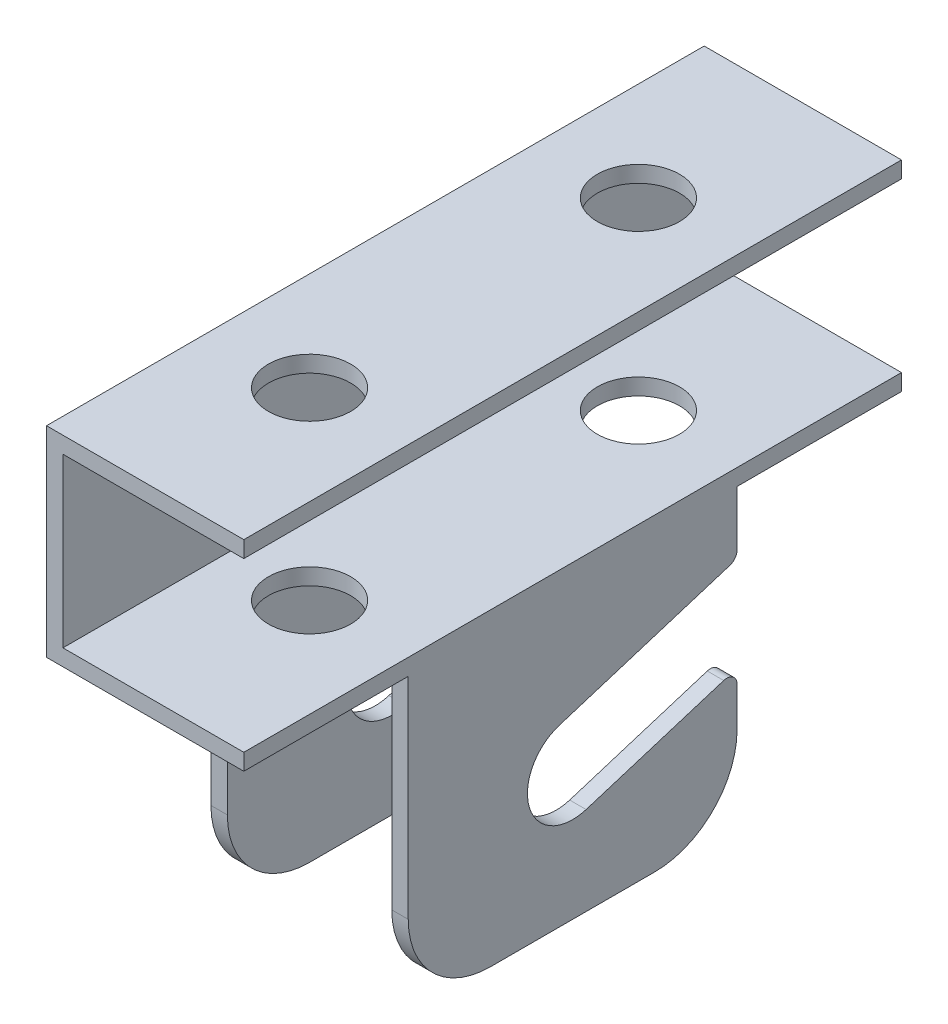
ISO-10303-21;
HEADER;
FILE_DESCRIPTION(('STEP AP214'),'2;1');
FILE_NAME('part.step','',(''),(''),'','','');
FILE_SCHEMA(('AUTOMOTIVE_DESIGN { 1 0 10303 214 1 1 1 1 }'));
ENDSEC;
DATA;
#1=APPLICATION_CONTEXT('core data for automotive mechanical design processes');
#2=APPLICATION_PROTOCOL_DEFINITION('international standard','automotive_design',2000,#1);
#3=PRODUCT_CONTEXT('',#1,'mechanical');
#4=PRODUCT('Part','Part','',(#3));
#5=PRODUCT_RELATED_PRODUCT_CATEGORY('part','',(#4));
#6=PRODUCT_DEFINITION_FORMATION('','',#4);
#7=PRODUCT_DEFINITION_CONTEXT('part definition',#1,'design');
#8=PRODUCT_DEFINITION('design','',#6,#7);
#9=PRODUCT_DEFINITION_SHAPE('','',#8);
#10=(LENGTH_UNIT() NAMED_UNIT(*) SI_UNIT(.MILLI.,.METRE.));
#11=(NAMED_UNIT(*) PLANE_ANGLE_UNIT() SI_UNIT($,.RADIAN.));
#12=(NAMED_UNIT(*) SI_UNIT($,.STERADIAN.) SOLID_ANGLE_UNIT());
#13=UNCERTAINTY_MEASURE_WITH_UNIT(LENGTH_MEASURE(1.E-05),#10,'distance_accuracy_value','');
#14=(GEOMETRIC_REPRESENTATION_CONTEXT(3) GLOBAL_UNCERTAINTY_ASSIGNED_CONTEXT((#13)) GLOBAL_UNIT_ASSIGNED_CONTEXT((#10,
#11,#12)) REPRESENTATION_CONTEXT('',''));
#15=CARTESIAN_POINT('',(0.,0.,0.));
#16=DIRECTION('',(0.,0.,1.));
#17=DIRECTION('',(1.,0.,0.));
#18=AXIS2_PLACEMENT_3D('',#15,#16,#17);
#19=CARTESIAN_POINT('',(0.,45.212,-25.4));
#20=DIRECTION('',(0.,0.,1.));
#21=DIRECTION('',(0.,-1.,0.));
#22=AXIS2_PLACEMENT_3D('',#19,#20,#21);
#23=PLANE('',#22);
#24=DIRECTION('',(0.,-1.,0.));
#25=VECTOR('',#24,1.);
#26=CARTESIAN_POINT('',(27.94,0.,-25.4));
#27=LINE('',#26,#25);
#28=CARTESIAN_POINT('',(27.94,18.7679927197062,-25.4));
#29=VERTEX_POINT('',#28);
#30=CARTESIAN_POINT('',(27.94,12.7,-25.4));
#31=VERTEX_POINT('',#30);
#32=EDGE_CURVE('E331',#29,#31,#27,.T.);
#33=ORIENTED_EDGE('',*,*,#32,.F.);
#34=DIRECTION('',(-1.,0.,0.));
#35=VECTOR('',#34,1.);
#36=CARTESIAN_POINT('',(0.,18.7679927197062,-25.4));
#37=LINE('',#36,#35);
#38=CARTESIAN_POINT('',(30.48,18.7679927197062,-25.4));
#39=VERTEX_POINT('',#38);
#40=EDGE_CURVE('E461',#29,#39,#37,.F.);
#41=ORIENTED_EDGE('',*,*,#40,.T.);
#42=DIRECTION('',(0.,1.,0.));
#43=VECTOR('',#42,1.);
#44=CARTESIAN_POINT('',(30.48,47.752,-25.4));
#45=LINE('',#44,#43);
#46=CARTESIAN_POINT('',(30.48,12.7,-25.4));
#47=VERTEX_POINT('',#46);
#48=EDGE_CURVE('E329',#47,#39,#45,.T.);
#49=ORIENTED_EDGE('',*,*,#48,.F.);
#50=DIRECTION('',(1.,0.,0.));
#51=VECTOR('',#50,1.);
#52=CARTESIAN_POINT('',(0.,12.7,-25.4));
#53=LINE('',#52,#51);
#54=EDGE_CURVE('E448',#47,#31,#53,.F.);
#55=ORIENTED_EDGE('',*,*,#54,.T.);
#56=EDGE_LOOP('',(#33,#41,#49,#55));
#57=FACE_BOUND('',#56,.T.);
#58=ADVANCED_FACE('F35',(#57),#23,.F.);
#59=DIRECTION('',(0.,-1.,0.));
#60=VECTOR('',#59,1.);
#61=CARTESIAN_POINT('',(0.,45.212,-25.4));
#62=LINE('',#61,#60);
#63=CARTESIAN_POINT('',(0.,18.7679927197062,-25.4));
#64=VERTEX_POINT('',#63);
#65=CARTESIAN_POINT('',(0.,12.7,-25.4));
#66=VERTEX_POINT('',#65);
#67=EDGE_CURVE('E316',#64,#66,#62,.T.);
#68=ORIENTED_EDGE('',*,*,#67,.F.);
#69=DIRECTION('',(1.,0.,0.));
#70=VECTOR('',#69,1.);
#71=CARTESIAN_POINT('',(0.,18.7679927197062,-25.4));
#72=LINE('',#71,#70);
#73=CARTESIAN_POINT('',(2.54,18.7679927197062,-25.4));
#74=VERTEX_POINT('',#73);
#75=EDGE_CURVE('E44',#64,#74,#72,.T.);
#76=ORIENTED_EDGE('',*,*,#75,.T.);
#77=DIRECTION('',(0.,1.,0.));
#78=VECTOR('',#77,1.);
#79=CARTESIAN_POINT('',(2.54,45.212,-25.4));
#80=LINE('',#79,#78);
#81=CARTESIAN_POINT('',(2.54,12.7,-25.4));
#82=VERTEX_POINT('',#81);
#83=EDGE_CURVE('E336',#82,#74,#80,.T.);
#84=ORIENTED_EDGE('',*,*,#83,.F.);
#85=DIRECTION('',(1.,0.,0.));
#86=VECTOR('',#85,1.);
#87=CARTESIAN_POINT('',(0.,12.7,-25.4));
#88=LINE('',#87,#86);
#89=EDGE_CURVE('E451',#82,#66,#88,.F.);
#90=ORIENTED_EDGE('',*,*,#89,.T.);
#91=EDGE_LOOP('',(#68,#76,#84,#90));
#92=FACE_BOUND('',#91,.T.);
#93=ADVANCED_FACE('F583',(#92),#23,.F.);
#94=CARTESIAN_POINT('',(2.54,0.,50.8));
#95=DIRECTION('',(0.,1.,0.));
#96=DIRECTION('',(-1.,0.,0.));
#97=AXIS2_PLACEMENT_3D('',#94,#95,#96);
#98=PLANE('',#97);
#99=DIRECTION('',(0.,0.,-1.));
#100=VECTOR('',#99,1.);
#101=CARTESIAN_POINT('',(2.54,0.,50.8));
#102=LINE('',#101,#100);
#103=CARTESIAN_POINT('',(2.54,0.,12.7));
#104=VERTEX_POINT('',#103);
#105=CARTESIAN_POINT('',(2.54,0.,-12.7));
#106=VERTEX_POINT('',#105);
#107=EDGE_CURVE('E413',#104,#106,#102,.T.);
#108=ORIENTED_EDGE('',*,*,#107,.F.);
#109=DIRECTION('',(1.,0.,0.));
#110=VECTOR('',#109,1.);
#111=CARTESIAN_POINT('',(2.54,0.,12.7));
#112=LINE('',#111,#110);
#113=CARTESIAN_POINT('',(0.,0.,12.7));
#114=VERTEX_POINT('',#113);
#115=EDGE_CURVE('E442',#104,#114,#112,.F.);
#116=ORIENTED_EDGE('',*,*,#115,.T.);
#117=DIRECTION('',(0.,0.,-1.));
#118=VECTOR('',#117,1.);
#119=CARTESIAN_POINT('',(0.,0.,50.8));
#120=LINE('',#119,#118);
#121=CARTESIAN_POINT('',(0.,0.,-12.7));
#122=VERTEX_POINT('',#121);
#123=EDGE_CURVE('E365',#114,#122,#120,.T.);
#124=ORIENTED_EDGE('',*,*,#123,.T.);
#125=DIRECTION('',(1.,0.,0.));
#126=VECTOR('',#125,1.);
#127=CARTESIAN_POINT('',(2.54,0.,-12.7));
#128=LINE('',#127,#126);
#129=EDGE_CURVE('E439',#122,#106,#128,.T.);
#130=ORIENTED_EDGE('',*,*,#129,.T.);
#131=EDGE_LOOP('',(#108,#116,#124,#130));
#132=FACE_BOUND('',#131,.T.);
#133=ADVANCED_FACE('F591',(#132),#98,.F.);
#134=CARTESIAN_POINT('',(2.54,45.212,50.8));
#135=DIRECTION('',(-1.,0.,0.));
#136=DIRECTION('',(0.,-1.,0.));
#137=AXIS2_PLACEMENT_3D('',#134,#135,#136);
#138=PLANE('',#137);
#139=DIRECTION('',(0.,0.297780601028373,-0.95463433504729));
#140=VECTOR('',#139,1.);
#141=CARTESIAN_POINT('',(2.54,14.7543797026228,41.2993062316393));
#142=LINE('',#141,#140);
#143=CARTESIAN_POINT('',(2.54,26.9881208303053,2.07999749818319));
#144=VERTEX_POINT('',#143);
#145=CARTESIAN_POINT('',(2.54,35.212266999136,-24.2852267041326));
#146=VERTEX_POINT('',#145);
#147=EDGE_CURVE('E290',#144,#146,#142,.T.);
#148=ORIENTED_EDGE('',*,*,#147,.T.);
#149=CARTESIAN_POINT('',(2.54,36.7277490060236,-23.8125));
#150=DIRECTION('',(-1.,0.,0.));
#151=DIRECTION('',(0.,-1.,0.));
#152=AXIS2_PLACEMENT_3D('',#149,#150,#151);
#153=CIRCLE('',#152,1.5875);
#154=CARTESIAN_POINT('',(2.54,36.7277490060236,-25.4));
#155=VERTEX_POINT('',#154);
#156=EDGE_CURVE('E481',#146,#155,#153,.F.);
#157=ORIENTED_EDGE('',*,*,#156,.T.);
#158=CARTESIAN_POINT('',(2.54,45.212,-25.4));
#159=VERTEX_POINT('',#158);
#160=EDGE_CURVE('E335',#155,#159,#80,.T.);
#161=ORIENTED_EDGE('',*,*,#160,.T.);
#162=DIRECTION('',(0.,0.,-1.));
#163=VECTOR('',#162,1.);
#164=CARTESIAN_POINT('',(2.54,45.212,50.8));
#165=LINE('',#164,#163);
#166=CARTESIAN_POINT('',(2.54,45.212,25.4));
#167=VERTEX_POINT('',#166);
#168=EDGE_CURVE('E410',#167,#159,#165,.T.);
#169=ORIENTED_EDGE('',*,*,#168,.F.);
#170=DIRECTION('',(0.,-1.,0.));
#171=VECTOR('',#170,1.);
#172=CARTESIAN_POINT('',(2.54,45.212,25.4));
#173=LINE('',#172,#171);
#174=CARTESIAN_POINT('',(2.54,12.7,25.4));
#175=VERTEX_POINT('',#174);
#176=EDGE_CURVE('E343',#167,#175,#173,.T.);
#177=ORIENTED_EDGE('',*,*,#176,.T.);
#178=CARTESIAN_POINT('',(2.54,12.7,12.7));
#179=DIRECTION('',(-1.,0.,0.));
#180=DIRECTION('',(0.,-1.,0.));
#181=AXIS2_PLACEMENT_3D('',#178,#179,#180);
#182=CIRCLE('',#181,12.7);
#183=EDGE_CURVE('E437',#175,#104,#182,.F.);
#184=ORIENTED_EDGE('',*,*,#183,.T.);
#185=ORIENTED_EDGE('',*,*,#107,.T.);
#186=CARTESIAN_POINT('',(2.54,12.7,-12.7));
#187=DIRECTION('',(-1.,0.,0.));
#188=DIRECTION('',(0.,-1.,0.));
#189=AXIS2_PLACEMENT_3D('',#186,#187,#188);
#190=CIRCLE('',#189,12.7);
#191=EDGE_CURVE('E435',#106,#82,#190,.F.);
#192=ORIENTED_EDGE('',*,*,#191,.T.);
#193=ORIENTED_EDGE('',*,*,#83,.T.);
#194=CARTESIAN_POINT('',(2.54,18.7679927197062,-23.8125));
#195=DIRECTION('',(-1.,0.,0.));
#196=DIRECTION('',(0.,-1.,0.));
#197=AXIS2_PLACEMENT_3D('',#194,#195,#196);
#198=CIRCLE('',#197,1.5875);
#199=CARTESIAN_POINT('',(2.54,20.2834747265937,-23.3397732958675));
#200=VERTEX_POINT('',#199);
#201=EDGE_CURVE('E52',#74,#200,#198,.F.);
#202=ORIENTED_EDGE('',*,*,#201,.T.);
#203=DIRECTION('',(0.,-0.297780601028374,0.95463433504729));
#204=VECTOR('',#203,1.);
#205=CARTESIAN_POINT('',(2.54,1.41813804201213,37.1393112352729));
#206=LINE('',#205,#204);
#207=CARTESIAN_POINT('',(2.54,13.6518791696947,-2.07999749818319));
#208=VERTEX_POINT('',#207);
#209=EDGE_CURVE('E296',#200,#208,#206,.T.);
#210=ORIENTED_EDGE('',*,*,#209,.T.);
#211=CARTESIAN_POINT('',(2.54,20.32,0.));
#212=DIRECTION('',(-1.,0.,0.));
#213=DIRECTION('',(0.,-1.,0.));
#214=AXIS2_PLACEMENT_3D('',#211,#212,#213);
#215=CIRCLE('',#214,6.985);
#216=EDGE_CURVE('E299',#208,#144,#215,.T.);
#217=ORIENTED_EDGE('',*,*,#216,.T.);
#218=EDGE_LOOP('',(#148,#157,#161,#169,#177,#184,#185,#192,#193,#202,#210,#217));
#219=FACE_BOUND('',#218,.T.);
#220=ADVANCED_FACE('F514',(#219),#138,.F.);
#221=CARTESIAN_POINT('',(27.94,45.212,50.8));
#222=DIRECTION('',(0.,1.,0.));
#223=DIRECTION('',(0.,0.,1.));
#224=AXIS2_PLACEMENT_3D('',#221,#222,#223);
#225=PLANE('',#224);
#226=CARTESIAN_POINT('',(15.24,45.212,-25.4));
#227=DIRECTION('',(0.,1.,0.));
#228=DIRECTION('',(0.,0.,1.));
#229=AXIS2_PLACEMENT_3D('',#226,#227,#228);
#230=CIRCLE('',#229,6.35);
#231=CARTESIAN_POINT('',(15.24,45.212,-19.05));
#232=VERTEX_POINT('',#231);
#233=EDGE_CURVE('E277',#232,#232,#230,.F.);
#234=ORIENTED_EDGE('',*,*,#233,.F.);
#235=EDGE_LOOP('',(#234));
#236=FACE_BOUND('',#235,.T.);
#237=CARTESIAN_POINT('',(15.24,45.212,25.4));
#238=DIRECTION('',(0.,1.,0.));
#239=DIRECTION('',(0.,0.,1.));
#240=AXIS2_PLACEMENT_3D('',#237,#238,#239);
#241=CIRCLE('',#240,6.35);
#242=CARTESIAN_POINT('',(15.24,45.212,31.75));
#243=VERTEX_POINT('',#242);
#244=EDGE_CURVE('E494',#243,#243,#241,.F.);
#245=ORIENTED_EDGE('',*,*,#244,.F.);
#246=EDGE_LOOP('',(#245));
#247=FACE_BOUND('',#246,.T.);
#248=DIRECTION('',(0.,0.,-1.));
#249=VECTOR('',#248,1.);
#250=CARTESIAN_POINT('',(27.94,45.212,50.8));
#251=LINE('',#250,#249);
#252=CARTESIAN_POINT('',(27.94,45.212,25.4));
#253=VERTEX_POINT('',#252);
#254=CARTESIAN_POINT('',(27.94,45.212,-25.4));
#255=VERTEX_POINT('',#254);
#256=EDGE_CURVE('E407',#253,#255,#251,.T.);
#257=ORIENTED_EDGE('',*,*,#256,.F.);
#258=DIRECTION('',(1.,0.,0.));
#259=VECTOR('',#258,1.);
#260=CARTESIAN_POINT('',(0.,45.212,25.4));
#261=LINE('',#260,#259);
#262=CARTESIAN_POINT('',(30.48,45.212,25.4));
#263=VERTEX_POINT('',#262);
#264=EDGE_CURVE('E309',#253,#263,#261,.T.);
#265=ORIENTED_EDGE('',*,*,#264,.T.);
#266=DIRECTION('',(0.,0.,-1.));
#267=VECTOR('',#266,1.);
#268=CARTESIAN_POINT('',(30.48,45.212,50.8));
#269=LINE('',#268,#267);
#270=CARTESIAN_POINT('',(30.48,45.212,50.8));
#271=VERTEX_POINT('',#270);
#272=EDGE_CURVE('E325',#271,#263,#269,.T.);
#273=ORIENTED_EDGE('',*,*,#272,.F.);
#274=DIRECTION('',(1.,0.,0.));
#275=VECTOR('',#274,1.);
#276=CARTESIAN_POINT('',(27.94,45.212,50.8));
#277=LINE('',#276,#275);
#278=CARTESIAN_POINT('',(0.,45.212,50.8));
#279=VERTEX_POINT('',#278);
#280=EDGE_CURVE('E347',#279,#271,#277,.T.);
#281=ORIENTED_EDGE('',*,*,#280,.F.);
#282=DIRECTION('',(0.,0.,1.));
#283=VECTOR('',#282,1.);
#284=CARTESIAN_POINT('',(0.,45.212,50.8));
#285=LINE('',#284,#283);
#286=CARTESIAN_POINT('',(0.,45.212,25.4));
#287=VERTEX_POINT('',#286);
#288=EDGE_CURVE('E305',#287,#279,#285,.T.);
#289=ORIENTED_EDGE('',*,*,#288,.F.);
#290=EDGE_CURVE('E310',#287,#167,#261,.T.);
#291=ORIENTED_EDGE('',*,*,#290,.T.);
#292=ORIENTED_EDGE('',*,*,#168,.T.);
#293=DIRECTION('',(1.,0.,0.));
#294=VECTOR('',#293,1.);
#295=CARTESIAN_POINT('',(0.,45.212,-25.4));
#296=LINE('',#295,#294);
#297=CARTESIAN_POINT('',(0.,45.212,-25.4));
#298=VERTEX_POINT('',#297);
#299=EDGE_CURVE('E306',#298,#159,#296,.T.);
#300=ORIENTED_EDGE('',*,*,#299,.F.);
#301=DIRECTION('',(0.,0.,1.));
#302=VECTOR('',#301,1.);
#303=CARTESIAN_POINT('',(0.,45.212,-50.8));
#304=LINE('',#303,#302);
#305=CARTESIAN_POINT('',(0.,45.212,-50.8));
#306=VERTEX_POINT('',#305);
#307=EDGE_CURVE('E302',#306,#298,#304,.T.);
#308=ORIENTED_EDGE('',*,*,#307,.F.);
#309=DIRECTION('',(1.,0.,0.));
#310=VECTOR('',#309,1.);
#311=CARTESIAN_POINT('',(27.94,45.212,-50.8));
#312=LINE('',#311,#310);
#313=CARTESIAN_POINT('',(30.48,45.212,-50.8));
#314=VERTEX_POINT('',#313);
#315=EDGE_CURVE('E346',#306,#314,#312,.T.);
#316=ORIENTED_EDGE('',*,*,#315,.T.);
#317=DIRECTION('',(0.,0.,-1.));
#318=VECTOR('',#317,1.);
#319=CARTESIAN_POINT('',(30.48,45.212,50.8));
#320=LINE('',#319,#318);
#321=CARTESIAN_POINT('',(30.48,45.212,-25.4));
#322=VERTEX_POINT('',#321);
#323=EDGE_CURVE('E313',#322,#314,#320,.T.);
#324=ORIENTED_EDGE('',*,*,#323,.F.);
#325=EDGE_CURVE('E320',#255,#322,#296,.T.);
#326=ORIENTED_EDGE('',*,*,#325,.F.);
#327=EDGE_LOOP('',(#257,#265,#273,#281,#289,#291,#292,#300,#308,#316,#324,#326));
#328=FACE_BOUND('',#327,.T.);
#329=ADVANCED_FACE('F510',(#236,#247,#328),#225,.F.);
#330=CARTESIAN_POINT('',(27.94,0.,50.8));
#331=DIRECTION('',(1.,0.,0.));
#332=DIRECTION('',(0.,1.,0.));
#333=AXIS2_PLACEMENT_3D('',#330,#331,#332);
#334=PLANE('',#333);
#335=DIRECTION('',(0.,0.297780601028374,-0.95463433504729));
#336=VECTOR('',#335,1.);
#337=CARTESIAN_POINT('',(27.94,-2.59095858039068,49.9917981838877));
#338=LINE('',#337,#336);
#339=CARTESIAN_POINT('',(27.94,13.6518791696947,-2.07999749818319));
#340=VERTEX_POINT('',#339);
#341=CARTESIAN_POINT('',(27.94,20.2834747265937,-23.3397732958675));
#342=VERTEX_POINT('',#341);
#343=EDGE_CURVE('E293',#340,#342,#338,.T.);
#344=ORIENTED_EDGE('',*,*,#343,.T.);
#345=CARTESIAN_POINT('',(27.94,18.7679927197062,-23.8125));
#346=DIRECTION('',(1.,0.,0.));
#347=DIRECTION('',(0.,1.,0.));
#348=AXIS2_PLACEMENT_3D('',#345,#346,#347);
#349=CIRCLE('',#348,1.5875);
#350=EDGE_CURVE('E459',#342,#29,#349,.F.);
#351=ORIENTED_EDGE('',*,*,#350,.T.);
#352=ORIENTED_EDGE('',*,*,#32,.T.);
#353=CARTESIAN_POINT('',(27.94,12.7,-12.7));
#354=DIRECTION('',(1.,0.,0.));
#355=DIRECTION('',(0.,1.,0.));
#356=AXIS2_PLACEMENT_3D('',#353,#354,#355);
#357=CIRCLE('',#356,12.7);
#358=CARTESIAN_POINT('',(27.94,0.,-12.7));
#359=VERTEX_POINT('',#358);
#360=EDGE_CURVE('E428',#31,#359,#357,.F.);
#361=ORIENTED_EDGE('',*,*,#360,.T.);
#362=DIRECTION('',(0.,0.,-1.));
#363=VECTOR('',#362,1.);
#364=CARTESIAN_POINT('',(27.94,0.,50.8));
#365=LINE('',#364,#363);
#366=CARTESIAN_POINT('',(27.94,0.,12.7));
#367=VERTEX_POINT('',#366);
#368=EDGE_CURVE('E404',#367,#359,#365,.T.);
#369=ORIENTED_EDGE('',*,*,#368,.F.);
#370=CARTESIAN_POINT('',(27.94,12.7,12.7));
#371=DIRECTION('',(1.,0.,0.));
#372=DIRECTION('',(0.,1.,0.));
#373=AXIS2_PLACEMENT_3D('',#370,#371,#372);
#374=CIRCLE('',#373,12.7);
#375=CARTESIAN_POINT('',(27.94,12.7,25.4));
#376=VERTEX_POINT('',#375);
#377=EDGE_CURVE('E430',#367,#376,#374,.F.);
#378=ORIENTED_EDGE('',*,*,#377,.T.);
#379=DIRECTION('',(0.,1.,0.));
#380=VECTOR('',#379,1.);
#381=CARTESIAN_POINT('',(27.94,0.,25.4));
#382=LINE('',#381,#380);
#383=EDGE_CURVE('E341',#376,#253,#382,.T.);
#384=ORIENTED_EDGE('',*,*,#383,.T.);
#385=ORIENTED_EDGE('',*,*,#256,.T.);
#386=CARTESIAN_POINT('',(27.94,36.7277490060236,-25.4));
#387=VERTEX_POINT('',#386);
#388=EDGE_CURVE('E332',#255,#387,#27,.T.);
#389=ORIENTED_EDGE('',*,*,#388,.T.);
#390=CARTESIAN_POINT('',(27.94,36.7277490060236,-23.8125));
#391=DIRECTION('',(1.,0.,0.));
#392=DIRECTION('',(0.,1.,0.));
#393=AXIS2_PLACEMENT_3D('',#390,#391,#392);
#394=CIRCLE('',#393,1.5875);
#395=CARTESIAN_POINT('',(27.94,35.212266999136,-24.2852267041326));
#396=VERTEX_POINT('',#395);
#397=EDGE_CURVE('E457',#387,#396,#394,.F.);
#398=ORIENTED_EDGE('',*,*,#397,.T.);
#399=DIRECTION('',(0.,-0.297780601028373,0.95463433504729));
#400=VECTOR('',#399,1.);
#401=CARTESIAN_POINT('',(27.94,10.74528308022,54.1517931802541));
#402=LINE('',#401,#400);
#403=CARTESIAN_POINT('',(27.94,26.9881208303053,2.07999749818319));
#404=VERTEX_POINT('',#403);
#405=EDGE_CURVE('E287',#396,#404,#402,.T.);
#406=ORIENTED_EDGE('',*,*,#405,.T.);
#407=CARTESIAN_POINT('',(27.94,20.32,0.));
#408=DIRECTION('',(1.,0.,0.));
#409=DIRECTION('',(0.,1.,0.));
#410=AXIS2_PLACEMENT_3D('',#407,#408,#409);
#411=CIRCLE('',#410,6.985);
#412=EDGE_CURVE('E253',#404,#340,#411,.T.);
#413=ORIENTED_EDGE('',*,*,#412,.T.);
#414=EDGE_LOOP('',(#344,#351,#352,#361,#369,#378,#384,#385,#389,#398,#406,#413));
#415=FACE_BOUND('',#414,.T.);
#416=ADVANCED_FACE('F513',(#415),#334,.F.);
#417=CARTESIAN_POINT('',(30.48,0.,50.8));
#418=DIRECTION('',(0.,1.,0.));
#419=DIRECTION('',(-1.,0.,0.));
#420=AXIS2_PLACEMENT_3D('',#417,#418,#419);
#421=PLANE('',#420);
#422=DIRECTION('',(0.,0.,-1.));
#423=VECTOR('',#422,1.);
#424=CARTESIAN_POINT('',(30.48,0.,50.8));
#425=LINE('',#424,#423);
#426=CARTESIAN_POINT('',(30.48,0.,12.7));
#427=VERTEX_POINT('',#426);
#428=CARTESIAN_POINT('',(30.48,0.,-12.7));
#429=VERTEX_POINT('',#428);
#430=EDGE_CURVE('E401',#427,#429,#425,.T.);
#431=ORIENTED_EDGE('',*,*,#430,.F.);
#432=DIRECTION('',(1.,0.,0.));
#433=VECTOR('',#432,1.);
#434=CARTESIAN_POINT('',(30.48,0.,12.7));
#435=LINE('',#434,#433);
#436=EDGE_CURVE('E426',#427,#367,#435,.F.);
#437=ORIENTED_EDGE('',*,*,#436,.T.);
#438=ORIENTED_EDGE('',*,*,#368,.T.);
#439=DIRECTION('',(1.,0.,0.));
#440=VECTOR('',#439,1.);
#441=CARTESIAN_POINT('',(30.48,0.,-12.7));
#442=LINE('',#441,#440);
#443=EDGE_CURVE('E423',#359,#429,#442,.T.);
#444=ORIENTED_EDGE('',*,*,#443,.T.);
#445=EDGE_LOOP('',(#431,#437,#438,#444));
#446=FACE_BOUND('',#445,.T.);
#447=ADVANCED_FACE('F645',(#446),#421,.F.);
#448=CARTESIAN_POINT('',(30.48,47.752,50.8));
#449=DIRECTION('',(-1.,0.,0.));
#450=DIRECTION('',(0.,-1.,0.));
#451=AXIS2_PLACEMENT_3D('',#448,#449,#450);
#452=PLANE('',#451);
#453=ORIENTED_EDGE('',*,*,#48,.T.);
#454=CARTESIAN_POINT('',(30.48,18.7679927197062,-23.8125));
#455=DIRECTION('',(-1.,0.,0.));
#456=DIRECTION('',(0.,-1.,0.));
#457=AXIS2_PLACEMENT_3D('',#454,#455,#456);
#458=CIRCLE('',#457,1.5875);
#459=CARTESIAN_POINT('',(30.48,20.2834747265937,-23.3397732958675));
#460=VERTEX_POINT('',#459);
#461=EDGE_CURVE('E465',#39,#460,#458,.F.);
#462=ORIENTED_EDGE('',*,*,#461,.T.);
#463=DIRECTION('',(0.,-0.297780601028374,0.95463433504729));
#464=VECTOR('',#463,1.);
#465=CARTESIAN_POINT('',(30.48,13.6518791696947,-2.07999749818319));
#466=LINE('',#465,#464);
#467=CARTESIAN_POINT('',(30.48,13.6518791696947,-2.07999749818319));
#468=VERTEX_POINT('',#467);
#469=EDGE_CURVE('E266',#460,#468,#466,.T.);
#470=ORIENTED_EDGE('',*,*,#469,.T.);
#471=CARTESIAN_POINT('',(30.48,20.32,0.));
#472=DIRECTION('',(-1.,0.,0.));
#473=DIRECTION('',(0.,0.,1.));
#474=AXIS2_PLACEMENT_3D('',#471,#472,#473);
#475=CIRCLE('',#474,6.985);
#476=CARTESIAN_POINT('',(30.48,26.9881208303053,2.07999749818319));
#477=VERTEX_POINT('',#476);
#478=EDGE_CURVE('E251',#468,#477,#475,.T.);
#479=ORIENTED_EDGE('',*,*,#478,.T.);
#480=DIRECTION('',(0.,0.297780601028373,-0.954634335047289));
#481=VECTOR('',#480,1.);
#482=CARTESIAN_POINT('',(30.48,26.9881208303053,2.07999749818319));
#483=LINE('',#482,#481);
#484=CARTESIAN_POINT('',(30.48,35.212266999136,-24.2852267041325));
#485=VERTEX_POINT('',#484);
#486=EDGE_CURVE('E260',#477,#485,#483,.T.);
#487=ORIENTED_EDGE('',*,*,#486,.T.);
#488=CARTESIAN_POINT('',(30.48,36.7277490060236,-23.8125));
#489=DIRECTION('',(-1.,0.,0.));
#490=DIRECTION('',(0.,-1.,0.));
#491=AXIS2_PLACEMENT_3D('',#488,#489,#490);
#492=CIRCLE('',#491,1.5875);
#493=CARTESIAN_POINT('',(30.48,36.7277490060236,-25.4));
#494=VERTEX_POINT('',#493);
#495=EDGE_CURVE('E463',#485,#494,#492,.F.);
#496=ORIENTED_EDGE('',*,*,#495,.T.);
#497=EDGE_CURVE('E328',#494,#322,#45,.T.);
#498=ORIENTED_EDGE('',*,*,#497,.T.);
#499=ORIENTED_EDGE('',*,*,#323,.T.);
#500=DIRECTION('',(0.,1.,0.));
#501=VECTOR('',#500,1.);
#502=CARTESIAN_POINT('',(30.48,47.752,-50.8));
#503=LINE('',#502,#501);
#504=CARTESIAN_POINT('',(30.48,47.752,-50.8));
#505=VERTEX_POINT('',#504);
#506=EDGE_CURVE('E367',#314,#505,#503,.T.);
#507=ORIENTED_EDGE('',*,*,#506,.T.);
#508=DIRECTION('',(0.,0.,-1.));
#509=VECTOR('',#508,1.);
#510=CARTESIAN_POINT('',(30.48,47.752,50.8));
#511=LINE('',#510,#509);
#512=CARTESIAN_POINT('',(30.48,47.752,50.8));
#513=VERTEX_POINT('',#512);
#514=EDGE_CURVE('E398',#513,#505,#511,.T.);
#515=ORIENTED_EDGE('',*,*,#514,.F.);
#516=DIRECTION('',(0.,1.,0.));
#517=VECTOR('',#516,1.);
#518=CARTESIAN_POINT('',(30.48,47.752,50.8));
#519=LINE('',#518,#517);
#520=EDGE_CURVE('E349',#271,#513,#519,.T.);
#521=ORIENTED_EDGE('',*,*,#520,.F.);
#522=ORIENTED_EDGE('',*,*,#272,.T.);
#523=DIRECTION('',(0.,-1.,0.));
#524=VECTOR('',#523,1.);
#525=CARTESIAN_POINT('',(30.48,47.752,25.4));
#526=LINE('',#525,#524);
#527=CARTESIAN_POINT('',(30.48,12.7,25.4));
#528=VERTEX_POINT('',#527);
#529=EDGE_CURVE('E338',#263,#528,#526,.T.);
#530=ORIENTED_EDGE('',*,*,#529,.T.);
#531=CARTESIAN_POINT('',(30.48,12.7,12.7));
#532=DIRECTION('',(-1.,0.,0.));
#533=DIRECTION('',(0.,-1.,0.));
#534=AXIS2_PLACEMENT_3D('',#531,#532,#533);
#535=CIRCLE('',#534,12.7);
#536=EDGE_CURVE('E421',#528,#427,#535,.F.);
#537=ORIENTED_EDGE('',*,*,#536,.T.);
#538=ORIENTED_EDGE('',*,*,#430,.T.);
#539=CARTESIAN_POINT('',(30.48,12.7,-12.7));
#540=DIRECTION('',(-1.,0.,0.));
#541=DIRECTION('',(0.,-1.,0.));
#542=AXIS2_PLACEMENT_3D('',#539,#540,#541);
#543=CIRCLE('',#542,12.7);
#544=EDGE_CURVE('E419',#429,#47,#543,.F.);
#545=ORIENTED_EDGE('',*,*,#544,.T.);
#546=EDGE_LOOP('',(#453,#462,#470,#479,#487,#496,#498,#499,#507,#515,#521,#522,#530,#537,#538,#545));
#547=FACE_BOUND('',#546,.T.);
#548=ADVANCED_FACE('F269',(#547),#452,.F.);
#549=CARTESIAN_POINT('',(2.54,47.752,50.8));
#550=DIRECTION('',(0.,-1.,0.));
#551=DIRECTION('',(0.,0.,-1.));
#552=AXIS2_PLACEMENT_3D('',#549,#550,#551);
#553=PLANE('',#552);
#554=CARTESIAN_POINT('',(15.24,47.752,-25.4));
#555=DIRECTION('',(0.,-1.,0.));
#556=DIRECTION('',(0.,0.,-1.));
#557=AXIS2_PLACEMENT_3D('',#554,#555,#556);
#558=CIRCLE('',#557,6.35);
#559=CARTESIAN_POINT('',(15.24,47.752,-31.75));
#560=VERTEX_POINT('',#559);
#561=EDGE_CURVE('E501',#560,#560,#558,.F.);
#562=ORIENTED_EDGE('',*,*,#561,.F.);
#563=EDGE_LOOP('',(#562));
#564=FACE_BOUND('',#563,.T.);
#565=CARTESIAN_POINT('',(15.24,47.752,25.4));
#566=DIRECTION('',(0.,-1.,0.));
#567=DIRECTION('',(0.,0.,-1.));
#568=AXIS2_PLACEMENT_3D('',#565,#566,#567);
#569=CIRCLE('',#568,6.35);
#570=CARTESIAN_POINT('',(15.24,47.752,19.05));
#571=VERTEX_POINT('',#570);
#572=EDGE_CURVE('E489',#571,#571,#569,.F.);
#573=ORIENTED_EDGE('',*,*,#572,.F.);
#574=EDGE_LOOP('',(#573));
#575=FACE_BOUND('',#574,.T.);
#576=DIRECTION('',(-1.,0.,0.));
#577=VECTOR('',#576,1.);
#578=CARTESIAN_POINT('',(2.54,47.752,-50.8));
#579=LINE('',#578,#577);
#580=CARTESIAN_POINT('',(2.54,47.752,-50.8));
#581=VERTEX_POINT('',#580);
#582=EDGE_CURVE('E369',#505,#581,#579,.T.);
#583=ORIENTED_EDGE('',*,*,#582,.T.);
#584=DIRECTION('',(0.,0.,-1.));
#585=VECTOR('',#584,1.);
#586=CARTESIAN_POINT('',(2.54,47.752,50.8));
#587=LINE('',#586,#585);
#588=CARTESIAN_POINT('',(2.54,47.752,50.8));
#589=VERTEX_POINT('',#588);
#590=EDGE_CURVE('E395',#589,#581,#587,.T.);
#591=ORIENTED_EDGE('',*,*,#590,.F.);
#592=DIRECTION('',(-1.,0.,0.));
#593=VECTOR('',#592,1.);
#594=CARTESIAN_POINT('',(2.54,47.752,50.8));
#595=LINE('',#594,#593);
#596=EDGE_CURVE('E352',#513,#589,#595,.T.);
#597=ORIENTED_EDGE('',*,*,#596,.F.);
#598=ORIENTED_EDGE('',*,*,#514,.T.);
#599=EDGE_LOOP('',(#583,#591,#597,#598));
#600=FACE_BOUND('',#599,.T.);
#601=ADVANCED_FACE('F691',(#564,#575,#600),#553,.F.);
#602=CARTESIAN_POINT('',(2.54,73.66,50.8));
#603=DIRECTION('',(-1.,0.,0.));
#604=DIRECTION('',(0.,-1.,0.));
#605=AXIS2_PLACEMENT_3D('',#602,#603,#604);
#606=PLANE('',#605);
#607=DIRECTION('',(0.,1.,0.));
#608=VECTOR('',#607,1.);
#609=CARTESIAN_POINT('',(2.54,73.66,-50.8));
#610=LINE('',#609,#608);
#611=CARTESIAN_POINT('',(2.54,73.66,-50.8));
#612=VERTEX_POINT('',#611);
#613=EDGE_CURVE('E371',#581,#612,#610,.T.);
#614=ORIENTED_EDGE('',*,*,#613,.T.);
#615=DIRECTION('',(0.,0.,-1.));
#616=VECTOR('',#615,1.);
#617=CARTESIAN_POINT('',(2.54,73.66,50.8));
#618=LINE('',#617,#616);
#619=CARTESIAN_POINT('',(2.54,73.66,50.8));
#620=VERTEX_POINT('',#619);
#621=EDGE_CURVE('E392',#620,#612,#618,.T.);
#622=ORIENTED_EDGE('',*,*,#621,.F.);
#623=DIRECTION('',(0.,1.,0.));
#624=VECTOR('',#623,1.);
#625=CARTESIAN_POINT('',(2.54,73.66,50.8));
#626=LINE('',#625,#624);
#627=EDGE_CURVE('E354',#589,#620,#626,.T.);
#628=ORIENTED_EDGE('',*,*,#627,.F.);
#629=ORIENTED_EDGE('',*,*,#590,.T.);
#630=EDGE_LOOP('',(#614,#622,#628,#629));
#631=FACE_BOUND('',#630,.T.);
#632=ADVANCED_FACE('F694',(#631),#606,.F.);
#633=CARTESIAN_POINT('',(30.48,73.66,50.8));
#634=DIRECTION('',(0.,1.,0.));
#635=DIRECTION('',(0.,0.,1.));
#636=AXIS2_PLACEMENT_3D('',#633,#634,#635);
#637=PLANE('',#636);
#638=CARTESIAN_POINT('',(15.24,73.66,-25.4));
#639=DIRECTION('',(0.,1.,0.));
#640=DIRECTION('',(0.,0.,1.));
#641=AXIS2_PLACEMENT_3D('',#638,#639,#640);
#642=CIRCLE('',#641,6.35);
#643=CARTESIAN_POINT('',(15.24,73.66,-19.05));
#644=VERTEX_POINT('',#643);
#645=EDGE_CURVE('E499',#644,#644,#642,.F.);
#646=ORIENTED_EDGE('',*,*,#645,.F.);
#647=EDGE_LOOP('',(#646));
#648=FACE_BOUND('',#647,.T.);
#649=CARTESIAN_POINT('',(15.24,73.66,25.4));
#650=DIRECTION('',(0.,1.,0.));
#651=DIRECTION('',(0.,0.,1.));
#652=AXIS2_PLACEMENT_3D('',#649,#650,#651);
#653=CIRCLE('',#652,6.35);
#654=CARTESIAN_POINT('',(15.24,73.66,31.75));
#655=VERTEX_POINT('',#654);
#656=EDGE_CURVE('E485',#655,#655,#653,.F.);
#657=ORIENTED_EDGE('',*,*,#656,.F.);
#658=EDGE_LOOP('',(#657));
#659=FACE_BOUND('',#658,.T.);
#660=DIRECTION('',(1.,0.,0.));
#661=VECTOR('',#660,1.);
#662=CARTESIAN_POINT('',(30.48,73.66,-50.8));
#663=LINE('',#662,#661);
#664=CARTESIAN_POINT('',(30.48,73.66,-50.8));
#665=VERTEX_POINT('',#664);
#666=EDGE_CURVE('E373',#612,#665,#663,.T.);
#667=ORIENTED_EDGE('',*,*,#666,.T.);
#668=DIRECTION('',(0.,0.,-1.));
#669=VECTOR('',#668,1.);
#670=CARTESIAN_POINT('',(30.48,73.66,50.8));
#671=LINE('',#670,#669);
#672=CARTESIAN_POINT('',(30.48,73.66,50.8));
#673=VERTEX_POINT('',#672);
#674=EDGE_CURVE('E389',#673,#665,#671,.T.);
#675=ORIENTED_EDGE('',*,*,#674,.F.);
#676=DIRECTION('',(1.,0.,0.));
#677=VECTOR('',#676,1.);
#678=CARTESIAN_POINT('',(30.48,73.66,50.8));
#679=LINE('',#678,#677);
#680=EDGE_CURVE('E356',#620,#673,#679,.T.);
#681=ORIENTED_EDGE('',*,*,#680,.F.);
#682=ORIENTED_EDGE('',*,*,#621,.T.);
#683=EDGE_LOOP('',(#667,#675,#681,#682));
#684=FACE_BOUND('',#683,.T.);
#685=ADVANCED_FACE('F706',(#648,#659,#684),#637,.F.);
#686=CARTESIAN_POINT('',(30.48,76.2,50.8));
#687=DIRECTION('',(-1.,0.,0.));
#688=DIRECTION('',(0.,0.,1.));
#689=AXIS2_PLACEMENT_3D('',#686,#687,#688);
#690=PLANE('',#689);
#691=DIRECTION('',(0.,1.,0.));
#692=VECTOR('',#691,1.);
#693=CARTESIAN_POINT('',(30.48,76.2,-50.8));
#694=LINE('',#693,#692);
#695=CARTESIAN_POINT('',(30.48,76.2,-50.8));
#696=VERTEX_POINT('',#695);
#697=EDGE_CURVE('E375',#665,#696,#694,.T.);
#698=ORIENTED_EDGE('',*,*,#697,.T.);
#699=DIRECTION('',(0.,0.,-1.));
#700=VECTOR('',#699,1.);
#701=CARTESIAN_POINT('',(30.48,76.2,50.8));
#702=LINE('',#701,#700);
#703=CARTESIAN_POINT('',(30.48,76.2,50.8));
#704=VERTEX_POINT('',#703);
#705=EDGE_CURVE('E386',#704,#696,#702,.T.);
#706=ORIENTED_EDGE('',*,*,#705,.F.);
#707=DIRECTION('',(0.,1.,0.));
#708=VECTOR('',#707,1.);
#709=CARTESIAN_POINT('',(30.48,76.2,50.8));
#710=LINE('',#709,#708);
#711=EDGE_CURVE('E358',#673,#704,#710,.T.);
#712=ORIENTED_EDGE('',*,*,#711,.F.);
#713=ORIENTED_EDGE('',*,*,#674,.T.);
#714=EDGE_LOOP('',(#698,#706,#712,#713));
#715=FACE_BOUND('',#714,.T.);
#716=ADVANCED_FACE('F709',(#715),#690,.F.);
#717=CARTESIAN_POINT('',(0.,76.2,50.8));
#718=DIRECTION('',(0.,-1.,0.));
#719=DIRECTION('',(0.,0.,-1.));
#720=AXIS2_PLACEMENT_3D('',#717,#718,#719);
#721=PLANE('',#720);
#722=CARTESIAN_POINT('',(15.24,76.2,-25.4));
#723=DIRECTION('',(0.,-1.,0.));
#724=DIRECTION('',(0.,0.,-1.));
#725=AXIS2_PLACEMENT_3D('',#722,#723,#724);
#726=CIRCLE('',#725,6.35);
#727=CARTESIAN_POINT('',(15.24,76.2,-31.75));
#728=VERTEX_POINT('',#727);
#729=EDGE_CURVE('E39',#728,#728,#726,.F.);
#730=ORIENTED_EDGE('',*,*,#729,.F.);
#731=EDGE_LOOP('',(#730));
#732=FACE_BOUND('',#731,.T.);
#733=CARTESIAN_POINT('',(15.24,76.2,25.4));
#734=DIRECTION('',(0.,-1.,0.));
#735=DIRECTION('',(0.,0.,-1.));
#736=AXIS2_PLACEMENT_3D('',#733,#734,#735);
#737=CIRCLE('',#736,6.35);
#738=CARTESIAN_POINT('',(15.24,76.2,19.05));
#739=VERTEX_POINT('',#738);
#740=EDGE_CURVE('E483',#739,#739,#737,.F.);
#741=ORIENTED_EDGE('',*,*,#740,.F.);
#742=EDGE_LOOP('',(#741));
#743=FACE_BOUND('',#742,.T.);
#744=DIRECTION('',(-1.,0.,0.));
#745=VECTOR('',#744,1.);
#746=CARTESIAN_POINT('',(0.,76.2,-50.8));
#747=LINE('',#746,#745);
#748=CARTESIAN_POINT('',(0.,76.2,-50.8));
#749=VERTEX_POINT('',#748);
#750=EDGE_CURVE('E377',#696,#749,#747,.T.);
#751=ORIENTED_EDGE('',*,*,#750,.T.);
#752=DIRECTION('',(0.,0.,-1.));
#753=VECTOR('',#752,1.);
#754=CARTESIAN_POINT('',(0.,76.2,50.8));
#755=LINE('',#754,#753);
#756=CARTESIAN_POINT('',(0.,76.2,50.8));
#757=VERTEX_POINT('',#756);
#758=EDGE_CURVE('E383',#757,#749,#755,.T.);
#759=ORIENTED_EDGE('',*,*,#758,.F.);
#760=DIRECTION('',(-1.,0.,0.));
#761=VECTOR('',#760,1.);
#762=CARTESIAN_POINT('',(0.,76.2,50.8));
#763=LINE('',#762,#761);
#764=EDGE_CURVE('E360',#704,#757,#763,.T.);
#765=ORIENTED_EDGE('',*,*,#764,.F.);
#766=ORIENTED_EDGE('',*,*,#705,.T.);
#767=EDGE_LOOP('',(#751,#759,#765,#766));
#768=FACE_BOUND('',#767,.T.);
#769=ADVANCED_FACE('F548',(#732,#743,#768),#721,.F.);
#770=CARTESIAN_POINT('',(0.,0.,50.8));
#771=DIRECTION('',(1.,0.,0.));
#772=DIRECTION('',(0.,0.,-1.));
#773=AXIS2_PLACEMENT_3D('',#770,#771,#772);
#774=PLANE('',#773);
#775=CARTESIAN_POINT('',(0.,36.7277490060236,-25.4));
#776=VERTEX_POINT('',#775);
#777=EDGE_CURVE('E317',#298,#776,#62,.T.);
#778=ORIENTED_EDGE('',*,*,#777,.T.);
#779=CARTESIAN_POINT('',(0.,36.7277490060236,-23.8125));
#780=DIRECTION('',(1.,0.,0.));
#781=DIRECTION('',(0.,0.,-1.));
#782=AXIS2_PLACEMENT_3D('',#779,#780,#781);
#783=CIRCLE('',#782,1.5875);
#784=CARTESIAN_POINT('',(0.,35.212266999136,-24.2852267041325));
#785=VERTEX_POINT('',#784);
#786=EDGE_CURVE('E476',#776,#785,#783,.F.);
#787=ORIENTED_EDGE('',*,*,#786,.T.);
#788=DIRECTION('',(0.,0.297780601028373,-0.954634335047289));
#789=VECTOR('',#788,1.);
#790=CARTESIAN_POINT('',(0.,26.9881208303053,2.07999749818319));
#791=LINE('',#790,#789);
#792=CARTESIAN_POINT('',(0.,26.9881208303053,2.07999749818319));
#793=VERTEX_POINT('',#792);
#794=EDGE_CURVE('E274',#793,#785,#791,.T.);
#795=ORIENTED_EDGE('',*,*,#794,.F.);
#796=CARTESIAN_POINT('',(0.,20.32,0.));
#797=DIRECTION('',(-1.,0.,0.));
#798=DIRECTION('',(0.,0.,1.));
#799=AXIS2_PLACEMENT_3D('',#796,#797,#798);
#800=CIRCLE('',#799,6.985);
#801=CARTESIAN_POINT('',(0.,13.6518791696947,-2.07999749818319));
#802=VERTEX_POINT('',#801);
#803=EDGE_CURVE('E281',#802,#793,#800,.T.);
#804=ORIENTED_EDGE('',*,*,#803,.F.);
#805=DIRECTION('',(0.,-0.297780601028374,0.95463433504729));
#806=VECTOR('',#805,1.);
#807=CARTESIAN_POINT('',(0.,13.6518791696947,-2.07999749818319));
#808=LINE('',#807,#806);
#809=CARTESIAN_POINT('',(0.,20.2834747265937,-23.3397732958675));
#810=VERTEX_POINT('',#809);
#811=EDGE_CURVE('E272',#810,#802,#808,.T.);
#812=ORIENTED_EDGE('',*,*,#811,.F.);
#813=CARTESIAN_POINT('',(0.,18.7679927197062,-23.8125));
#814=DIRECTION('',(1.,0.,0.));
#815=DIRECTION('',(0.,0.,-1.));
#816=AXIS2_PLACEMENT_3D('',#813,#814,#815);
#817=CIRCLE('',#816,1.5875);
#818=EDGE_CURVE('E474',#810,#64,#817,.F.);
#819=ORIENTED_EDGE('',*,*,#818,.T.);
#820=ORIENTED_EDGE('',*,*,#67,.T.);
#821=CARTESIAN_POINT('',(0.,12.7,-12.7));
#822=DIRECTION('',(1.,0.,0.));
#823=DIRECTION('',(0.,0.,-1.));
#824=AXIS2_PLACEMENT_3D('',#821,#822,#823);
#825=CIRCLE('',#824,12.7);
#826=EDGE_CURVE('E444',#66,#122,#825,.F.);
#827=ORIENTED_EDGE('',*,*,#826,.T.);
#828=ORIENTED_EDGE('',*,*,#123,.F.);
#829=CARTESIAN_POINT('',(0.,12.7,12.7));
#830=DIRECTION('',(1.,0.,0.));
#831=DIRECTION('',(0.,0.,-1.));
#832=AXIS2_PLACEMENT_3D('',#829,#830,#831);
#833=CIRCLE('',#832,12.7);
#834=CARTESIAN_POINT('',(0.,12.7,25.4));
#835=VERTEX_POINT('',#834);
#836=EDGE_CURVE('E446',#114,#835,#833,.F.);
#837=ORIENTED_EDGE('',*,*,#836,.T.);
#838=DIRECTION('',(0.,1.,0.));
#839=VECTOR('',#838,1.);
#840=CARTESIAN_POINT('',(0.,45.212,25.4));
#841=LINE('',#840,#839);
#842=EDGE_CURVE('E303',#835,#287,#841,.T.);
#843=ORIENTED_EDGE('',*,*,#842,.T.);
#844=ORIENTED_EDGE('',*,*,#288,.T.);
#845=DIRECTION('',(0.,-1.,0.));
#846=VECTOR('',#845,1.);
#847=CARTESIAN_POINT('',(0.,0.,50.8));
#848=LINE('',#847,#846);
#849=EDGE_CURVE('E362',#757,#279,#848,.T.);
#850=ORIENTED_EDGE('',*,*,#849,.F.);
#851=ORIENTED_EDGE('',*,*,#758,.T.);
#852=DIRECTION('',(0.,-1.,0.));
#853=VECTOR('',#852,1.);
#854=CARTESIAN_POINT('',(0.,0.,-50.8));
#855=LINE('',#854,#853);
#856=EDGE_CURVE('E350',#749,#306,#855,.T.);
#857=ORIENTED_EDGE('',*,*,#856,.T.);
#858=ORIENTED_EDGE('',*,*,#307,.T.);
#859=EDGE_LOOP('',(#778,#787,#795,#804,#812,#819,#820,#827,#828,#837,#843,#844,#850,#851,#857,#858));
#860=FACE_BOUND('',#859,.T.);
#861=ADVANCED_FACE('F539',(#860),#774,.F.);
#862=CARTESIAN_POINT('',(0.,0.,50.8));
#863=DIRECTION('',(0.,0.,-1.));
#864=DIRECTION('',(-1.,0.,0.));
#865=AXIS2_PLACEMENT_3D('',#862,#863,#864);
#866=PLANE('',#865);
#867=ORIENTED_EDGE('',*,*,#849,.T.);
#868=ORIENTED_EDGE('',*,*,#280,.T.);
#869=ORIENTED_EDGE('',*,*,#520,.T.);
#870=ORIENTED_EDGE('',*,*,#596,.T.);
#871=ORIENTED_EDGE('',*,*,#627,.T.);
#872=ORIENTED_EDGE('',*,*,#680,.T.);
#873=ORIENTED_EDGE('',*,*,#711,.T.);
#874=ORIENTED_EDGE('',*,*,#764,.T.);
#875=EDGE_LOOP('',(#867,#868,#869,#870,#871,#872,#873,#874));
#876=FACE_BOUND('',#875,.T.);
#877=ADVANCED_FACE('F542',(#876),#866,.F.);
#878=CARTESIAN_POINT('',(0.,0.,-50.8));
#879=DIRECTION('',(0.,0.,-1.));
#880=DIRECTION('',(-1.,0.,0.));
#881=AXIS2_PLACEMENT_3D('',#878,#879,#880);
#882=PLANE('',#881);
#883=ORIENTED_EDGE('',*,*,#315,.F.);
#884=ORIENTED_EDGE('',*,*,#856,.F.);
#885=ORIENTED_EDGE('',*,*,#750,.F.);
#886=ORIENTED_EDGE('',*,*,#697,.F.);
#887=ORIENTED_EDGE('',*,*,#666,.F.);
#888=ORIENTED_EDGE('',*,*,#613,.F.);
#889=ORIENTED_EDGE('',*,*,#582,.F.);
#890=ORIENTED_EDGE('',*,*,#506,.F.);
#891=EDGE_LOOP('',(#883,#884,#885,#886,#887,#888,#889,#890));
#892=FACE_BOUND('',#891,.T.);
#893=ADVANCED_FACE('F552',(#892),#882,.T.);
#894=ORIENTED_EDGE('',*,*,#497,.F.);
#895=DIRECTION('',(-1.,0.,0.));
#896=VECTOR('',#895,1.);
#897=CARTESIAN_POINT('',(0.,36.7277490060236,-25.4));
#898=LINE('',#897,#896);
#899=EDGE_CURVE('E467',#494,#387,#898,.T.);
#900=ORIENTED_EDGE('',*,*,#899,.T.);
#901=ORIENTED_EDGE('',*,*,#388,.F.);
#902=ORIENTED_EDGE('',*,*,#325,.T.);
#903=EDGE_LOOP('',(#894,#900,#901,#902));
#904=FACE_BOUND('',#903,.T.);
#905=ADVANCED_FACE('F615',(#904),#23,.F.);
#906=ORIENTED_EDGE('',*,*,#160,.F.);
#907=DIRECTION('',(-1.,0.,0.));
#908=VECTOR('',#907,1.);
#909=CARTESIAN_POINT('',(0.,36.7277490060236,-25.4));
#910=LINE('',#909,#908);
#911=EDGE_CURVE('E471',#155,#776,#910,.T.);
#912=ORIENTED_EDGE('',*,*,#911,.T.);
#913=ORIENTED_EDGE('',*,*,#777,.F.);
#914=ORIENTED_EDGE('',*,*,#299,.T.);
#915=EDGE_LOOP('',(#906,#912,#913,#914));
#916=FACE_BOUND('',#915,.T.);
#917=ADVANCED_FACE('F561',(#916),#23,.F.);
#918=CARTESIAN_POINT('',(0.,45.212,25.4));
#919=DIRECTION('',(0.,0.,-1.));
#920=DIRECTION('',(0.,1.,0.));
#921=AXIS2_PLACEMENT_3D('',#918,#919,#920);
#922=PLANE('',#921);
#923=ORIENTED_EDGE('',*,*,#383,.F.);
#924=DIRECTION('',(1.,0.,0.));
#925=VECTOR('',#924,1.);
#926=CARTESIAN_POINT('',(0.,12.7,25.4));
#927=LINE('',#926,#925);
#928=EDGE_CURVE('E416',#376,#528,#927,.T.);
#929=ORIENTED_EDGE('',*,*,#928,.T.);
#930=ORIENTED_EDGE('',*,*,#529,.F.);
#931=ORIENTED_EDGE('',*,*,#264,.F.);
#932=EDGE_LOOP('',(#923,#929,#930,#931));
#933=FACE_BOUND('',#932,.T.);
#934=ADVANCED_FACE('F531',(#933),#922,.F.);
#935=ORIENTED_EDGE('',*,*,#842,.F.);
#936=DIRECTION('',(1.,0.,0.));
#937=VECTOR('',#936,1.);
#938=CARTESIAN_POINT('',(0.,12.7,25.4));
#939=LINE('',#938,#937);
#940=EDGE_CURVE('E432',#835,#175,#939,.T.);
#941=ORIENTED_EDGE('',*,*,#940,.T.);
#942=ORIENTED_EDGE('',*,*,#176,.F.);
#943=ORIENTED_EDGE('',*,*,#290,.F.);
#944=EDGE_LOOP('',(#935,#941,#942,#943));
#945=FACE_BOUND('',#944,.T.);
#946=ADVANCED_FACE('F599',(#945),#922,.F.);
#947=CARTESIAN_POINT('',(30.48,26.9881208303053,2.07999749818319));
#948=DIRECTION('',(0.,0.95463433504729,0.297780601028373));
#949=DIRECTION('',(0.,-0.297780601028373,0.95463433504729));
#950=AXIS2_PLACEMENT_3D('',#947,#948,#949);
#951=PLANE('',#950);
#952=ORIENTED_EDGE('',*,*,#794,.T.);
#953=DIRECTION('',(-1.,0.,0.));
#954=VECTOR('',#953,1.);
#955=CARTESIAN_POINT('',(30.48,35.212266999136,-24.2852267041325));
#956=LINE('',#955,#954);
#957=EDGE_CURVE('E478',#785,#146,#956,.F.);
#958=ORIENTED_EDGE('',*,*,#957,.T.);
#959=ORIENTED_EDGE('',*,*,#147,.F.);
#960=DIRECTION('',(-1.,0.,0.));
#961=VECTOR('',#960,1.);
#962=CARTESIAN_POINT('',(30.48,26.9881208303053,2.07999749818319));
#963=LINE('',#962,#961);
#964=EDGE_CURVE('E257',#144,#793,#963,.T.);
#965=ORIENTED_EDGE('',*,*,#964,.T.);
#966=EDGE_LOOP('',(#952,#958,#959,#965));
#967=FACE_BOUND('',#966,.T.);
#968=ADVANCED_FACE('F568',(#967),#951,.F.);
#969=CARTESIAN_POINT('',(30.48,13.6518791696947,-2.07999749818319));
#970=DIRECTION('',(0.,-0.95463433504729,-0.297780601028374));
#971=DIRECTION('',(0.,0.297780601028374,-0.95463433504729));
#972=AXIS2_PLACEMENT_3D('',#969,#970,#971);
#973=PLANE('',#972);
#974=ORIENTED_EDGE('',*,*,#209,.F.);
#975=DIRECTION('',(1.,0.,0.));
#976=VECTOR('',#975,1.);
#977=CARTESIAN_POINT('',(30.48,20.2834747265937,-23.3397732958675));
#978=LINE('',#977,#976);
#979=EDGE_CURVE('E11',#200,#810,#978,.F.);
#980=ORIENTED_EDGE('',*,*,#979,.T.);
#981=ORIENTED_EDGE('',*,*,#811,.T.);
#982=DIRECTION('',(-1.,0.,0.));
#983=VECTOR('',#982,1.);
#984=CARTESIAN_POINT('',(30.48,13.6518791696947,-2.07999749818319));
#985=LINE('',#984,#983);
#986=EDGE_CURVE('E256',#208,#802,#985,.T.);
#987=ORIENTED_EDGE('',*,*,#986,.F.);
#988=EDGE_LOOP('',(#974,#980,#981,#987));
#989=FACE_BOUND('',#988,.T.);
#990=ADVANCED_FACE('F577',(#989),#973,.F.);
#991=CARTESIAN_POINT('',(30.48,20.32,0.));
#992=DIRECTION('',(-1.,0.,0.));
#993=DIRECTION('',(0.,0.,1.));
#994=AXIS2_PLACEMENT_3D('',#991,#992,#993);
#995=CYLINDRICAL_SURFACE('',#994,6.985);
#996=ORIENTED_EDGE('',*,*,#986,.T.);
#997=ORIENTED_EDGE('',*,*,#803,.T.);
#998=ORIENTED_EDGE('',*,*,#964,.F.);
#999=ORIENTED_EDGE('',*,*,#216,.F.);
#1000=EDGE_LOOP('',(#996,#997,#998,#999));
#1001=FACE_BOUND('',#1000,.T.);
#1002=ADVANCED_FACE('F574',(#1001),#995,.F.);
#1003=EDGE_CURVE('E246',#477,#404,#963,.T.);
#1004=ORIENTED_EDGE('',*,*,#1003,.F.);
#1005=ORIENTED_EDGE('',*,*,#478,.F.);
#1006=EDGE_CURVE('E286',#468,#340,#985,.T.);
#1007=ORIENTED_EDGE('',*,*,#1006,.T.);
#1008=ORIENTED_EDGE('',*,*,#412,.F.);
#1009=EDGE_LOOP('',(#1004,#1005,#1007,#1008));
#1010=FACE_BOUND('',#1009,.T.);
#1011=ADVANCED_FACE('F248',(#1010),#995,.F.);
#1012=ORIENTED_EDGE('',*,*,#469,.F.);
#1013=DIRECTION('',(-1.,0.,0.));
#1014=VECTOR('',#1013,1.);
#1015=CARTESIAN_POINT('',(30.48,20.2834747265937,-23.3397732958675));
#1016=LINE('',#1015,#1014);
#1017=EDGE_CURVE('E454',#460,#342,#1016,.T.);
#1018=ORIENTED_EDGE('',*,*,#1017,.T.);
#1019=ORIENTED_EDGE('',*,*,#343,.F.);
#1020=ORIENTED_EDGE('',*,*,#1006,.F.);
#1021=EDGE_LOOP('',(#1012,#1018,#1019,#1020));
#1022=FACE_BOUND('',#1021,.T.);
#1023=ADVANCED_FACE('F632',(#1022),#973,.F.);
#1024=ORIENTED_EDGE('',*,*,#405,.F.);
#1025=DIRECTION('',(-1.,0.,0.));
#1026=VECTOR('',#1025,1.);
#1027=CARTESIAN_POINT('',(30.48,35.212266999136,-24.2852267041325));
#1028=LINE('',#1027,#1026);
#1029=EDGE_CURVE('E263',#396,#485,#1028,.F.);
#1030=ORIENTED_EDGE('',*,*,#1029,.T.);
#1031=ORIENTED_EDGE('',*,*,#486,.F.);
#1032=ORIENTED_EDGE('',*,*,#1003,.T.);
#1033=EDGE_LOOP('',(#1024,#1030,#1031,#1032));
#1034=FACE_BOUND('',#1033,.T.);
#1035=ADVANCED_FACE('F261',(#1034),#951,.F.);
#1036=CARTESIAN_POINT('',(0.,12.7,12.7));
#1037=DIRECTION('',(1.,0.,0.));
#1038=DIRECTION('',(0.,1.,0.));
#1039=AXIS2_PLACEMENT_3D('',#1036,#1037,#1038);
#1040=CYLINDRICAL_SURFACE('',#1039,12.7);
#1041=ORIENTED_EDGE('',*,*,#377,.F.);
#1042=ORIENTED_EDGE('',*,*,#436,.F.);
#1043=ORIENTED_EDGE('',*,*,#536,.F.);
#1044=ORIENTED_EDGE('',*,*,#928,.F.);
#1045=EDGE_LOOP('',(#1041,#1042,#1043,#1044));
#1046=FACE_BOUND('',#1045,.T.);
#1047=ADVANCED_FACE('F648',(#1046),#1040,.T.);
#1048=CARTESIAN_POINT('',(0.,12.7,12.7));
#1049=DIRECTION('',(1.,0.,0.));
#1050=DIRECTION('',(0.,1.,0.));
#1051=AXIS2_PLACEMENT_3D('',#1048,#1049,#1050);
#1052=CYLINDRICAL_SURFACE('',#1051,12.7);
#1053=ORIENTED_EDGE('',*,*,#836,.F.);
#1054=ORIENTED_EDGE('',*,*,#115,.F.);
#1055=ORIENTED_EDGE('',*,*,#183,.F.);
#1056=ORIENTED_EDGE('',*,*,#940,.F.);
#1057=EDGE_LOOP('',(#1053,#1054,#1055,#1056));
#1058=FACE_BOUND('',#1057,.T.);
#1059=ADVANCED_FACE('F597',(#1058),#1052,.T.);
#1060=CARTESIAN_POINT('',(30.48,12.7,-12.7));
#1061=DIRECTION('',(1.,0.,0.));
#1062=DIRECTION('',(0.,1.,0.));
#1063=AXIS2_PLACEMENT_3D('',#1060,#1061,#1062);
#1064=CYLINDRICAL_SURFACE('',#1063,12.7);
#1065=ORIENTED_EDGE('',*,*,#360,.F.);
#1066=ORIENTED_EDGE('',*,*,#54,.F.);
#1067=ORIENTED_EDGE('',*,*,#544,.F.);
#1068=ORIENTED_EDGE('',*,*,#443,.F.);
#1069=EDGE_LOOP('',(#1065,#1066,#1067,#1068));
#1070=FACE_BOUND('',#1069,.T.);
#1071=ADVANCED_FACE('F643',(#1070),#1064,.T.);
#1072=CARTESIAN_POINT('',(2.54000000000001,12.7,-12.7));
#1073=DIRECTION('',(1.,0.,0.));
#1074=DIRECTION('',(0.,1.,0.));
#1075=AXIS2_PLACEMENT_3D('',#1072,#1073,#1074);
#1076=CYLINDRICAL_SURFACE('',#1075,12.7);
#1077=ORIENTED_EDGE('',*,*,#826,.F.);
#1078=ORIENTED_EDGE('',*,*,#89,.F.);
#1079=ORIENTED_EDGE('',*,*,#191,.F.);
#1080=ORIENTED_EDGE('',*,*,#129,.F.);
#1081=EDGE_LOOP('',(#1077,#1078,#1079,#1080));
#1082=FACE_BOUND('',#1081,.T.);
#1083=ADVANCED_FACE('F589',(#1082),#1076,.T.);
#1084=CARTESIAN_POINT('',(30.48,18.7679927197062,-23.8125));
#1085=DIRECTION('',(-1.,0.,0.));
#1086=DIRECTION('',(0.,0.,1.));
#1087=AXIS2_PLACEMENT_3D('',#1084,#1085,#1086);
#1088=CYLINDRICAL_SURFACE('',#1087,1.5875);
#1089=ORIENTED_EDGE('',*,*,#461,.F.);
#1090=ORIENTED_EDGE('',*,*,#40,.F.);
#1091=ORIENTED_EDGE('',*,*,#350,.F.);
#1092=ORIENTED_EDGE('',*,*,#1017,.F.);
#1093=EDGE_LOOP('',(#1089,#1090,#1091,#1092));
#1094=FACE_BOUND('',#1093,.T.);
#1095=ADVANCED_FACE('F636',(#1094),#1088,.T.);
#1096=CARTESIAN_POINT('',(0.,36.7277490060236,-23.8125));
#1097=DIRECTION('',(-1.,0.,0.));
#1098=DIRECTION('',(0.,0.,1.));
#1099=AXIS2_PLACEMENT_3D('',#1096,#1097,#1098);
#1100=CYLINDRICAL_SURFACE('',#1099,1.5875);
#1101=ORIENTED_EDGE('',*,*,#495,.F.);
#1102=ORIENTED_EDGE('',*,*,#1029,.F.);
#1103=ORIENTED_EDGE('',*,*,#397,.F.);
#1104=ORIENTED_EDGE('',*,*,#899,.F.);
#1105=EDGE_LOOP('',(#1101,#1102,#1103,#1104));
#1106=FACE_BOUND('',#1105,.T.);
#1107=ADVANCED_FACE('F630',(#1106),#1100,.T.);
#1108=CARTESIAN_POINT('',(0.,36.7277490060236,-23.8125));
#1109=DIRECTION('',(-1.,0.,0.));
#1110=DIRECTION('',(0.,0.,1.));
#1111=AXIS2_PLACEMENT_3D('',#1108,#1109,#1110);
#1112=CYLINDRICAL_SURFACE('',#1111,1.5875);
#1113=ORIENTED_EDGE('',*,*,#156,.F.);
#1114=ORIENTED_EDGE('',*,*,#957,.F.);
#1115=ORIENTED_EDGE('',*,*,#786,.F.);
#1116=ORIENTED_EDGE('',*,*,#911,.F.);
#1117=EDGE_LOOP('',(#1113,#1114,#1115,#1116));
#1118=FACE_BOUND('',#1117,.T.);
#1119=ADVANCED_FACE('F565',(#1118),#1112,.T.);
#1120=CARTESIAN_POINT('',(0.,18.7679927197062,-23.8125));
#1121=DIRECTION('',(1.,0.,0.));
#1122=DIRECTION('',(0.,0.,-1.));
#1123=AXIS2_PLACEMENT_3D('',#1120,#1121,#1122);
#1124=CYLINDRICAL_SURFACE('',#1123,1.5875);
#1125=ORIENTED_EDGE('',*,*,#818,.F.);
#1126=ORIENTED_EDGE('',*,*,#979,.F.);
#1127=ORIENTED_EDGE('',*,*,#201,.F.);
#1128=ORIENTED_EDGE('',*,*,#75,.F.);
#1129=EDGE_LOOP('',(#1125,#1126,#1127,#1128));
#1130=FACE_BOUND('',#1129,.T.);
#1131=ADVANCED_FACE('F37',(#1130),#1124,.T.);
#1132=CARTESIAN_POINT('',(15.24,76.200012,25.4));
#1133=DIRECTION('',(0.,-1.,0.));
#1134=DIRECTION('',(0.,0.,-1.));
#1135=AXIS2_PLACEMENT_3D('',#1132,#1133,#1134);
#1136=CYLINDRICAL_SURFACE('',#1135,6.35);
#1137=ORIENTED_EDGE('',*,*,#740,.T.);
#1138=EDGE_LOOP('',(#1137));
#1139=FACE_BOUND('',#1138,.T.);
#1140=ORIENTED_EDGE('',*,*,#656,.T.);
#1141=EDGE_LOOP('',(#1140));
#1142=FACE_BOUND('',#1141,.T.);
#1143=ADVANCED_FACE('F670',(#1139,#1142),#1136,.F.);
#1144=CARTESIAN_POINT('',(15.24,76.200012,-25.4));
#1145=DIRECTION('',(0.,-1.,0.));
#1146=DIRECTION('',(0.,0.,-1.));
#1147=AXIS2_PLACEMENT_3D('',#1144,#1145,#1146);
#1148=CYLINDRICAL_SURFACE('',#1147,6.35);
#1149=ORIENTED_EDGE('',*,*,#729,.T.);
#1150=EDGE_LOOP('',(#1149));
#1151=FACE_BOUND('',#1150,.T.);
#1152=ORIENTED_EDGE('',*,*,#645,.T.);
#1153=EDGE_LOOP('',(#1152));
#1154=FACE_BOUND('',#1153,.T.);
#1155=ADVANCED_FACE('F674',(#1151,#1154),#1148,.F.);
#1156=ORIENTED_EDGE('',*,*,#572,.T.);
#1157=EDGE_LOOP('',(#1156));
#1158=FACE_BOUND('',#1157,.T.);
#1159=ORIENTED_EDGE('',*,*,#244,.T.);
#1160=EDGE_LOOP('',(#1159));
#1161=FACE_BOUND('',#1160,.T.);
#1162=ADVANCED_FACE('F676',(#1158,#1161),#1136,.F.);
#1163=ORIENTED_EDGE('',*,*,#561,.T.);
#1164=EDGE_LOOP('',(#1163));
#1165=FACE_BOUND('',#1164,.T.);
#1166=ORIENTED_EDGE('',*,*,#233,.T.);
#1167=EDGE_LOOP('',(#1166));
#1168=FACE_BOUND('',#1167,.T.);
#1169=ADVANCED_FACE('F508',(#1165,#1168),#1148,.F.);
#1170=CLOSED_SHELL('',(#58,#93,#133,#220,#329,#416,#447,#548,#601,#632,#685,#716,#769,#861,#877,
#893,#905,#917,#934,#946,#968,#990,#1002,#1011,#1023,#1035,#1047,#1059,#1071,#1083,#1095,#1107,
#1119,#1131,#1143,#1155,#1162,#1169));
#1171=MANIFOLD_SOLID_BREP('B2',#1170);
#1172=ADVANCED_BREP_SHAPE_REPRESENTATION('',(#18,#1171),#14);
#1173=SHAPE_DEFINITION_REPRESENTATION(#9,#1172);
ENDSEC;
END-ISO-10303-21;
